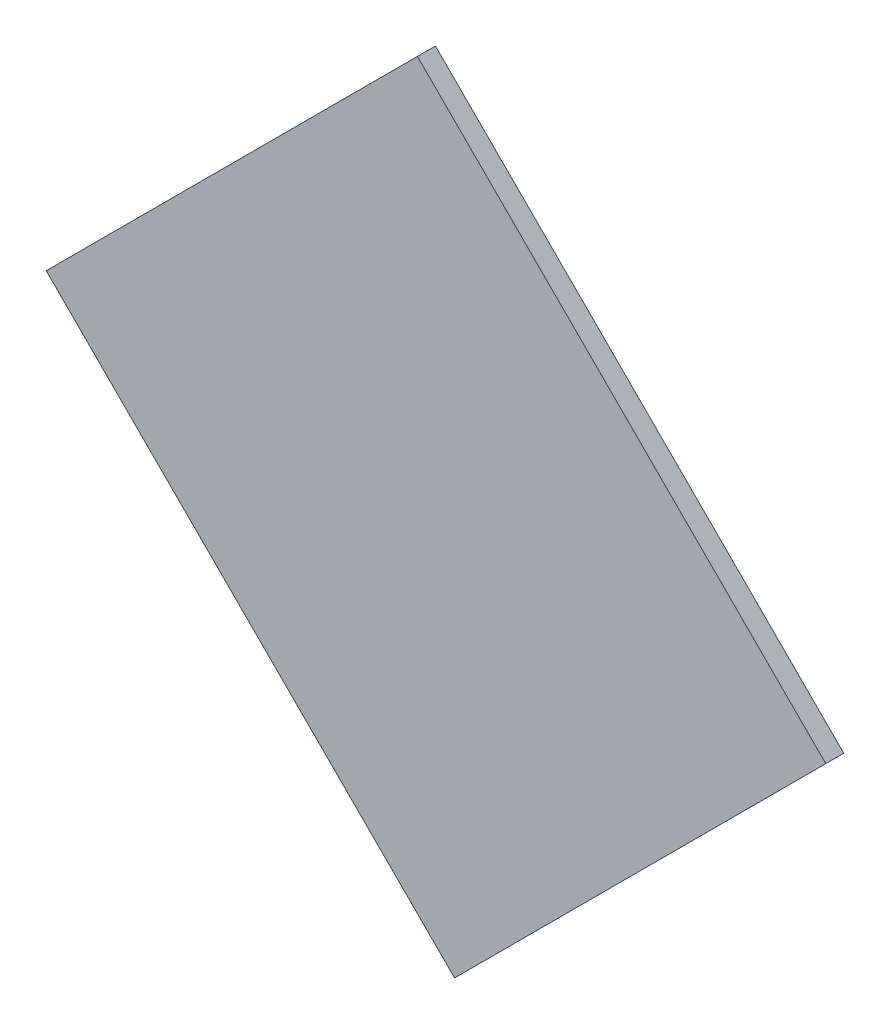
ISO-10303-21;
HEADER;
FILE_DESCRIPTION(('STEP AP214'),'2;1');
FILE_NAME('part.step','',(''),(''),'','','');
FILE_SCHEMA(('AUTOMOTIVE_DESIGN { 1 0 10303 214 1 1 1 1 }'));
ENDSEC;
DATA;
#1=APPLICATION_CONTEXT('core data for automotive mechanical design processes');
#2=APPLICATION_PROTOCOL_DEFINITION('international standard','automotive_design',2000,#1);
#3=PRODUCT_CONTEXT('',#1,'mechanical');
#4=PRODUCT('Part','Part','',(#3));
#5=PRODUCT_RELATED_PRODUCT_CATEGORY('part','',(#4));
#6=PRODUCT_DEFINITION_FORMATION('','',#4);
#7=PRODUCT_DEFINITION_CONTEXT('part definition',#1,'design');
#8=PRODUCT_DEFINITION('design','',#6,#7);
#9=PRODUCT_DEFINITION_SHAPE('','',#8);
#10=(LENGTH_UNIT() NAMED_UNIT(*) SI_UNIT(.MILLI.,.METRE.));
#11=(NAMED_UNIT(*) PLANE_ANGLE_UNIT() SI_UNIT($,.RADIAN.));
#12=(NAMED_UNIT(*) SI_UNIT($,.STERADIAN.) SOLID_ANGLE_UNIT());
#13=UNCERTAINTY_MEASURE_WITH_UNIT(LENGTH_MEASURE(1.E-05),#10,'distance_accuracy_value','');
#14=(GEOMETRIC_REPRESENTATION_CONTEXT(3) GLOBAL_UNCERTAINTY_ASSIGNED_CONTEXT((#13)) GLOBAL_UNIT_ASSIGNED_CONTEXT((#10,
#11,#12)) REPRESENTATION_CONTEXT('',''));
#15=CARTESIAN_POINT('',(0.,0.,0.));
#16=DIRECTION('',(0.,0.,1.));
#17=DIRECTION('',(1.,0.,0.));
#18=AXIS2_PLACEMENT_3D('',#15,#16,#17);
#19=CARTESIAN_POINT('',(10.006066,6.761604,0.79916));
#20=DIRECTION('',(0.,0.,1.));
#21=DIRECTION('',(0.,-1.,0.));
#22=AXIS2_PLACEMENT_3D('',#19,#20,#21);
#23=PLANE('',#22);
#24=DIRECTION('',(0.707106781186548,0.707106781186548,0.));
#25=VECTOR('',#24,1.);
#26=CARTESIAN_POINT('',(9.263604,6.796959333,0.79916));
#27=LINE('',#26,#25);
#28=CARTESIAN_POINT('',(9.970710667,7.504066,0.79916));
#29=VERTEX_POINT('',#28);
#30=CARTESIAN_POINT('',(9.263604,6.796959333,0.79916));
#31=VERTEX_POINT('',#30);
#32=EDGE_CURVE('E68',#29,#31,#27,.F.);
#33=ORIENTED_EDGE('',*,*,#32,.T.);
#34=DIRECTION('',(-0.707106781186548,0.707106781186548,0.));
#35=VECTOR('',#34,1.);
#36=CARTESIAN_POINT('',(10.041421333,6.019142,0.79916));
#37=LINE('',#36,#35);
#38=CARTESIAN_POINT('',(10.041421333,6.019142,0.79916));
#39=VERTEX_POINT('',#38);
#40=EDGE_CURVE('E55',#31,#39,#37,.F.);
#41=ORIENTED_EDGE('',*,*,#40,.T.);
#42=DIRECTION('',(-0.707106781186548,-0.707106781186548,0.));
#43=VECTOR('',#42,1.);
#44=CARTESIAN_POINT('',(10.748528,6.726248667,0.79916));
#45=LINE('',#44,#43);
#46=CARTESIAN_POINT('',(10.748528,6.726248667,0.79916));
#47=VERTEX_POINT('',#46);
#48=EDGE_CURVE('E20',#39,#47,#45,.F.);
#49=ORIENTED_EDGE('',*,*,#48,.T.);
#50=DIRECTION('',(0.707106781186548,-0.707106781186548,0.));
#51=VECTOR('',#50,1.);
#52=CARTESIAN_POINT('',(9.970710667,7.504066,0.79916));
#53=LINE('',#52,#51);
#54=EDGE_CURVE('E81',#47,#29,#53,.F.);
#55=ORIENTED_EDGE('',*,*,#54,.T.);
#56=EDGE_LOOP('',(#33,#41,#49,#55));
#57=FACE_BOUND('',#56,.T.);
#58=ADVANCED_FACE('F17',(#57),#23,.T.);
#59=CARTESIAN_POINT('',(10.748528,6.726248667,0.76487));
#60=DIRECTION('',(-0.707106781186548,0.707106781186548,0.));
#61=DIRECTION('',(-0.707106781186548,-0.707106781186548,0.));
#62=AXIS2_PLACEMENT_3D('',#59,#60,#61);
#63=PLANE('',#62);
#64=DIRECTION('',(0.,0.,1.));
#65=VECTOR('',#64,1.);
#66=CARTESIAN_POINT('',(10.041421333,6.019142,0.76487));
#67=LINE('',#66,#65);
#68=CARTESIAN_POINT('',(10.041421333,6.019142,0.76487));
#69=VERTEX_POINT('',#68);
#70=EDGE_CURVE('E61',#39,#69,#67,.F.);
#71=ORIENTED_EDGE('',*,*,#70,.T.);
#72=DIRECTION('',(-0.707106781186547,-0.707106781186547,0.));
#73=VECTOR('',#72,1.);
#74=CARTESIAN_POINT('',(10.748528,6.726248667,0.76487));
#75=LINE('',#74,#73);
#76=CARTESIAN_POINT('',(10.748528,6.726248667,0.76487));
#77=VERTEX_POINT('',#76);
#78=EDGE_CURVE('E83',#77,#69,#75,.T.);
#79=ORIENTED_EDGE('',*,*,#78,.F.);
#80=DIRECTION('',(0.,0.,1.));
#81=VECTOR('',#80,1.);
#82=CARTESIAN_POINT('',(10.748528,6.726248667,0.76487));
#83=LINE('',#82,#81);
#84=EDGE_CURVE('E64',#77,#47,#83,.T.);
#85=ORIENTED_EDGE('',*,*,#84,.T.);
#86=ORIENTED_EDGE('',*,*,#48,.F.);
#87=EDGE_LOOP('',(#71,#79,#85,#86));
#88=FACE_BOUND('',#87,.T.);
#89=ADVANCED_FACE('F60',(#88),#63,.F.);
#90=CARTESIAN_POINT('',(10.041421333,6.019142,0.76487));
#91=DIRECTION('',(0.707106781186548,0.707106781186548,0.));
#92=DIRECTION('',(-0.707106781186548,0.707106781186548,0.));
#93=AXIS2_PLACEMENT_3D('',#90,#91,#92);
#94=PLANE('',#93);
#95=DIRECTION('',(0.,0.,1.));
#96=VECTOR('',#95,1.);
#97=CARTESIAN_POINT('',(9.263604,6.796959333,0.76487));
#98=LINE('',#97,#96);
#99=CARTESIAN_POINT('',(9.263604,6.796959333,0.76487));
#100=VERTEX_POINT('',#99);
#101=EDGE_CURVE('E70',#31,#100,#98,.F.);
#102=ORIENTED_EDGE('',*,*,#101,.T.);
#103=DIRECTION('',(-0.707106781186547,0.707106781186547,0.));
#104=VECTOR('',#103,1.);
#105=CARTESIAN_POINT('',(10.041421333,6.019142,0.76487));
#106=LINE('',#105,#104);
#107=EDGE_CURVE('E74',#69,#100,#106,.T.);
#108=ORIENTED_EDGE('',*,*,#107,.F.);
#109=ORIENTED_EDGE('',*,*,#70,.F.);
#110=ORIENTED_EDGE('',*,*,#40,.F.);
#111=EDGE_LOOP('',(#102,#108,#109,#110));
#112=FACE_BOUND('',#111,.T.);
#113=ADVANCED_FACE('F72',(#112),#94,.F.);
#114=CARTESIAN_POINT('',(9.263604,6.796959333,0.76487));
#115=DIRECTION('',(0.707106781186548,-0.707106781186548,0.));
#116=DIRECTION('',(0.707106781186548,0.707106781186548,0.));
#117=AXIS2_PLACEMENT_3D('',#114,#115,#116);
#118=PLANE('',#117);
#119=DIRECTION('',(0.,0.,1.));
#120=VECTOR('',#119,1.);
#121=CARTESIAN_POINT('',(9.970710667,7.504066,0.76487));
#122=LINE('',#121,#120);
#123=CARTESIAN_POINT('',(9.970710667,7.504066,0.76487));
#124=VERTEX_POINT('',#123);
#125=EDGE_CURVE('E35',#29,#124,#122,.F.);
#126=ORIENTED_EDGE('',*,*,#125,.T.);
#127=DIRECTION('',(0.707106781186547,0.707106781186548,0.));
#128=VECTOR('',#127,1.);
#129=CARTESIAN_POINT('',(9.263604,6.796959333,0.76487));
#130=LINE('',#129,#128);
#131=EDGE_CURVE('E26',#100,#124,#130,.T.);
#132=ORIENTED_EDGE('',*,*,#131,.F.);
#133=ORIENTED_EDGE('',*,*,#101,.F.);
#134=ORIENTED_EDGE('',*,*,#32,.F.);
#135=EDGE_LOOP('',(#126,#132,#133,#134));
#136=FACE_BOUND('',#135,.T.);
#137=ADVANCED_FACE('F89',(#136),#118,.F.);
#138=CARTESIAN_POINT('',(9.970710667,7.504066,0.76487));
#139=DIRECTION('',(-0.707106781186548,-0.707106781186548,0.));
#140=DIRECTION('',(0.707106781186548,-0.707106781186548,0.));
#141=AXIS2_PLACEMENT_3D('',#138,#139,#140);
#142=PLANE('',#141);
#143=ORIENTED_EDGE('',*,*,#84,.F.);
#144=DIRECTION('',(0.707106781186547,-0.707106781186548,0.));
#145=VECTOR('',#144,1.);
#146=CARTESIAN_POINT('',(9.970710667,7.504066,0.76487));
#147=LINE('',#146,#145);
#148=EDGE_CURVE('E11',#124,#77,#147,.T.);
#149=ORIENTED_EDGE('',*,*,#148,.F.);
#150=ORIENTED_EDGE('',*,*,#125,.F.);
#151=ORIENTED_EDGE('',*,*,#54,.F.);
#152=EDGE_LOOP('',(#143,#149,#150,#151));
#153=FACE_BOUND('',#152,.T.);
#154=ADVANCED_FACE('F91',(#153),#142,.F.);
#155=CARTESIAN_POINT('',(10.006066,6.761604,0.76487));
#156=DIRECTION('',(0.,0.,-1.));
#157=DIRECTION('',(0.,1.,0.));
#158=AXIS2_PLACEMENT_3D('',#155,#156,#157);
#159=PLANE('',#158);
#160=ORIENTED_EDGE('',*,*,#131,.T.);
#161=ORIENTED_EDGE('',*,*,#148,.T.);
#162=ORIENTED_EDGE('',*,*,#78,.T.);
#163=ORIENTED_EDGE('',*,*,#107,.T.);
#164=EDGE_LOOP('',(#160,#161,#162,#163));
#165=FACE_BOUND('',#164,.T.);
#166=ADVANCED_FACE('F88',(#165),#159,.T.);
#167=CLOSED_SHELL('',(#58,#89,#113,#137,#154,#166));
#168=MANIFOLD_SOLID_BREP('B1',#167);
#169=ADVANCED_BREP_SHAPE_REPRESENTATION('',(#18,#168),#14);
#170=SHAPE_DEFINITION_REPRESENTATION(#9,#169);
ENDSEC;
END-ISO-10303-21;
